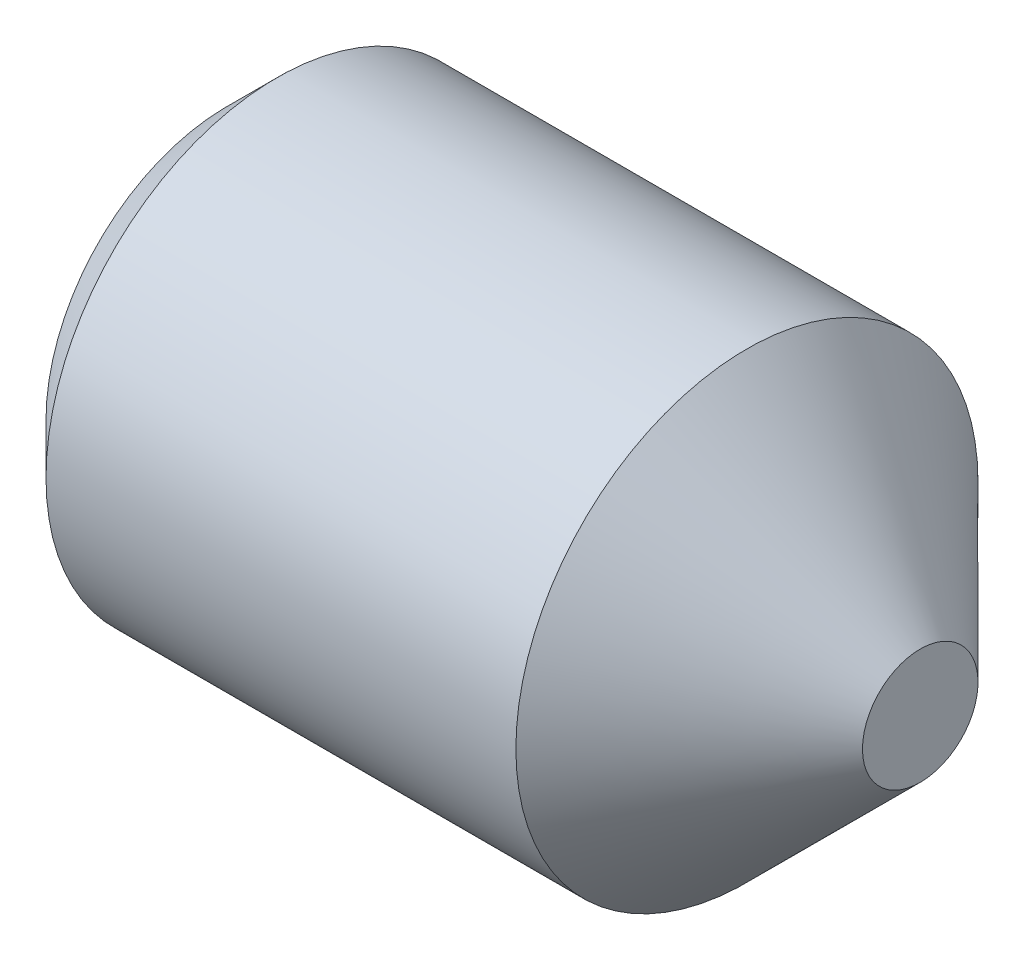
ISO-10303-21;
HEADER;
FILE_DESCRIPTION(('STEP AP214'),'2;1');
FILE_NAME('part.step','',(''),(''),'','','');
FILE_SCHEMA(('AUTOMOTIVE_DESIGN { 1 0 10303 214 1 1 1 1 }'));
ENDSEC;
DATA;
#1=APPLICATION_CONTEXT('core data for automotive mechanical design processes');
#2=APPLICATION_PROTOCOL_DEFINITION('international standard','automotive_design',2000,#1);
#3=PRODUCT_CONTEXT('',#1,'mechanical');
#4=PRODUCT('Part','Part','',(#3));
#5=PRODUCT_RELATED_PRODUCT_CATEGORY('part','',(#4));
#6=PRODUCT_DEFINITION_FORMATION('','',#4);
#7=PRODUCT_DEFINITION_CONTEXT('part definition',#1,'design');
#8=PRODUCT_DEFINITION('design','',#6,#7);
#9=PRODUCT_DEFINITION_SHAPE('','',#8);
#10=(LENGTH_UNIT() NAMED_UNIT(*) SI_UNIT(.MILLI.,.METRE.));
#11=(NAMED_UNIT(*) PLANE_ANGLE_UNIT() SI_UNIT($,.RADIAN.));
#12=(NAMED_UNIT(*) SI_UNIT($,.STERADIAN.) SOLID_ANGLE_UNIT());
#13=UNCERTAINTY_MEASURE_WITH_UNIT(LENGTH_MEASURE(1.E-05),#10,'distance_accuracy_value','');
#14=(GEOMETRIC_REPRESENTATION_CONTEXT(3) GLOBAL_UNCERTAINTY_ASSIGNED_CONTEXT((#13)) GLOBAL_UNIT_ASSIGNED_CONTEXT((#10,
#11,#12)) REPRESENTATION_CONTEXT('',''));
#15=CARTESIAN_POINT('',(0.,0.,0.));
#16=DIRECTION('',(0.,0.,1.));
#17=DIRECTION('',(1.,0.,0.));
#18=AXIS2_PLACEMENT_3D('',#15,#16,#17);
#19=CARTESIAN_POINT('',(0.799999999886313,0.,0.519615242270663));
#20=DIRECTION('',(-1.,0.,0.));
#21=DIRECTION('',(0.,0.,1.));
#22=AXIS2_PLACEMENT_3D('',#19,#20,#21);
#23=PLANE('',#22);
#24=DIRECTION('',(0.,0.,-1.));
#25=VECTOR('',#24,1.);
#26=CARTESIAN_POINT('',(0.799999999886313,0.45,0.259807621135332));
#27=LINE('',#26,#25);
#28=CARTESIAN_POINT('',(0.799999999886313,0.45,0.259807621135332));
#29=VERTEX_POINT('',#28);
#30=CARTESIAN_POINT('',(0.799999999886313,0.45,0.));
#31=VERTEX_POINT('',#30);
#32=EDGE_CURVE('E160',#29,#31,#27,.T.);
#33=ORIENTED_EDGE('',*,*,#32,.T.);
#34=CARTESIAN_POINT('',(0.799999999886313,0.,0.));
#35=DIRECTION('',(1.,0.,0.));
#36=DIRECTION('',(0.,1.,0.));
#37=AXIS2_PLACEMENT_3D('',#34,#35,#36);
#38=CIRCLE('',#37,0.45);
#39=CARTESIAN_POINT('',(0.799999999886313,0.225,0.389711431702997));
#40=VERTEX_POINT('',#39);
#41=EDGE_CURVE('E49',#31,#40,#38,.T.);
#42=ORIENTED_EDGE('',*,*,#41,.T.);
#43=DIRECTION('',(0.,0.866025403784438,-0.5));
#44=VECTOR('',#43,1.);
#45=CARTESIAN_POINT('',(0.799999999886313,0.,0.519615242270663));
#46=LINE('',#45,#44);
#47=EDGE_CURVE('E216',#40,#29,#46,.T.);
#48=ORIENTED_EDGE('',*,*,#47,.T.);
#49=EDGE_LOOP('',(#33,#42,#48));
#50=FACE_BOUND('',#49,.T.);
#51=ADVANCED_FACE('F38',(#50),#23,.T.);
#52=CARTESIAN_POINT('',(0.799999999886313,0.,0.519615242270663));
#53=VERTEX_POINT('',#52);
#54=EDGE_CURVE('E221',#53,#40,#46,.T.);
#55=ORIENTED_EDGE('',*,*,#54,.T.);
#56=CARTESIAN_POINT('',(0.799999999886313,-0.225,0.389711431702997));
#57=VERTEX_POINT('',#56);
#58=EDGE_CURVE('E11',#40,#57,#38,.T.);
#59=ORIENTED_EDGE('',*,*,#58,.T.);
#60=DIRECTION('',(0.,0.866025403784438,0.5));
#61=VECTOR('',#60,1.);
#62=CARTESIAN_POINT('',(0.799999999886313,-0.45,0.259807621135332));
#63=LINE('',#62,#61);
#64=EDGE_CURVE('E186',#57,#53,#63,.T.);
#65=ORIENTED_EDGE('',*,*,#64,.T.);
#66=EDGE_LOOP('',(#55,#59,#65));
#67=FACE_BOUND('',#66,.T.);
#68=ADVANCED_FACE('F125',(#67),#23,.T.);
#69=CARTESIAN_POINT('',(0.799999999886313,-0.45,0.259807621135332));
#70=VERTEX_POINT('',#69);
#71=EDGE_CURVE('E222',#70,#57,#63,.T.);
#72=ORIENTED_EDGE('',*,*,#71,.T.);
#73=CARTESIAN_POINT('',(0.799999999886313,-0.45,0.));
#74=VERTEX_POINT('',#73);
#75=EDGE_CURVE('E47',#57,#74,#38,.T.);
#76=ORIENTED_EDGE('',*,*,#75,.T.);
#77=DIRECTION('',(0.,0.,1.));
#78=VECTOR('',#77,1.);
#79=CARTESIAN_POINT('',(0.799999999886313,-0.45,-0.259807621135331));
#80=LINE('',#79,#78);
#81=EDGE_CURVE('E165',#74,#70,#80,.T.);
#82=ORIENTED_EDGE('',*,*,#81,.T.);
#83=EDGE_LOOP('',(#72,#76,#82));
#84=FACE_BOUND('',#83,.T.);
#85=ADVANCED_FACE('F131',(#84),#23,.T.);
#86=CARTESIAN_POINT('',(0.799999999886313,-0.45,-0.259807621135331));
#87=VERTEX_POINT('',#86);
#88=EDGE_CURVE('E166',#87,#74,#80,.T.);
#89=ORIENTED_EDGE('',*,*,#88,.T.);
#90=CARTESIAN_POINT('',(0.799999999886313,-0.225,-0.389711431702997));
#91=VERTEX_POINT('',#90);
#92=EDGE_CURVE('E213',#74,#91,#38,.T.);
#93=ORIENTED_EDGE('',*,*,#92,.T.);
#94=DIRECTION('',(0.,-0.866025403784439,0.5));
#95=VECTOR('',#94,1.);
#96=CARTESIAN_POINT('',(0.799999999886313,0.,-0.519615242270663));
#97=LINE('',#96,#95);
#98=EDGE_CURVE('E155',#91,#87,#97,.T.);
#99=ORIENTED_EDGE('',*,*,#98,.T.);
#100=EDGE_LOOP('',(#89,#93,#99));
#101=FACE_BOUND('',#100,.T.);
#102=ADVANCED_FACE('F144',(#101),#23,.T.);
#103=CARTESIAN_POINT('',(0.799999999886313,0.,-0.519615242270663));
#104=VERTEX_POINT('',#103);
#105=EDGE_CURVE('E158',#104,#91,#97,.T.);
#106=ORIENTED_EDGE('',*,*,#105,.T.);
#107=CARTESIAN_POINT('',(0.799999999886313,0.225,-0.389711431702997));
#108=VERTEX_POINT('',#107);
#109=EDGE_CURVE('E211',#91,#108,#38,.T.);
#110=ORIENTED_EDGE('',*,*,#109,.T.);
#111=DIRECTION('',(0.,-0.866025403784438,-0.5));
#112=VECTOR('',#111,1.);
#113=CARTESIAN_POINT('',(0.799999999886313,0.45,-0.259807621135332));
#114=LINE('',#113,#112);
#115=EDGE_CURVE('E156',#108,#104,#114,.T.);
#116=ORIENTED_EDGE('',*,*,#115,.T.);
#117=EDGE_LOOP('',(#106,#110,#116));
#118=FACE_BOUND('',#117,.T.);
#119=ADVANCED_FACE('F136',(#118),#23,.T.);
#120=CARTESIAN_POINT('',(0.799999999886313,0.45,-0.259807621135332));
#121=VERTEX_POINT('',#120);
#122=EDGE_CURVE('E148',#121,#108,#114,.T.);
#123=ORIENTED_EDGE('',*,*,#122,.T.);
#124=EDGE_CURVE('E149',#108,#31,#38,.T.);
#125=ORIENTED_EDGE('',*,*,#124,.T.);
#126=EDGE_CURVE('E151',#31,#121,#27,.T.);
#127=ORIENTED_EDGE('',*,*,#126,.T.);
#128=EDGE_LOOP('',(#123,#125,#127));
#129=FACE_BOUND('',#128,.T.);
#130=ADVANCED_FACE('F127',(#129),#23,.T.);
#131=CARTESIAN_POINT('',(0.,0.7835,0.));
#132=DIRECTION('',(1.,0.,0.));
#133=DIRECTION('',(0.,0.,-1.));
#134=AXIS2_PLACEMENT_3D('',#131,#132,#133);
#135=PLANE('',#134);
#136=DIRECTION('',(0.,0.866025403784438,-0.5));
#137=VECTOR('',#136,1.);
#138=CARTESIAN_POINT('',(-1.13686837721616E-10,0.,0.519615242270663));
#139=LINE('',#138,#137);
#140=CARTESIAN_POINT('',(0.,0.,0.519615242270663));
#141=VERTEX_POINT('',#140);
#142=CARTESIAN_POINT('',(-1.13686837721616E-10,0.45,0.259807621135332));
#143=VERTEX_POINT('',#142);
#144=EDGE_CURVE('E171',#141,#143,#139,.T.);
#145=ORIENTED_EDGE('',*,*,#144,.F.);
#146=DIRECTION('',(0.,0.866025403784438,0.5));
#147=VECTOR('',#146,1.);
#148=CARTESIAN_POINT('',(-1.13686837721616E-10,-0.45,0.259807621135332));
#149=LINE('',#148,#147);
#150=CARTESIAN_POINT('',(-1.13686837721616E-10,-0.45,0.259807621135332));
#151=VERTEX_POINT('',#150);
#152=EDGE_CURVE('E63',#151,#141,#149,.T.);
#153=ORIENTED_EDGE('',*,*,#152,.F.);
#154=DIRECTION('',(0.,0.,1.));
#155=VECTOR('',#154,1.);
#156=CARTESIAN_POINT('',(-1.13686837721616E-10,-0.45,-0.259807621135331));
#157=LINE('',#156,#155);
#158=CARTESIAN_POINT('',(-1.13686837721616E-10,-0.45,-0.259807621135331));
#159=VERTEX_POINT('',#158);
#160=EDGE_CURVE('E183',#159,#151,#157,.T.);
#161=ORIENTED_EDGE('',*,*,#160,.F.);
#162=DIRECTION('',(0.,-0.866025403784439,0.5));
#163=VECTOR('',#162,1.);
#164=CARTESIAN_POINT('',(-1.13686837721616E-10,0.,-0.519615242270663));
#165=LINE('',#164,#163);
#166=CARTESIAN_POINT('',(-1.13686837721616E-10,0.,-0.519615242270663));
#167=VERTEX_POINT('',#166);
#168=EDGE_CURVE('E180',#167,#159,#165,.T.);
#169=ORIENTED_EDGE('',*,*,#168,.F.);
#170=DIRECTION('',(0.,-0.866025403784438,-0.5));
#171=VECTOR('',#170,1.);
#172=CARTESIAN_POINT('',(-1.13686837721616E-10,0.45,-0.259807621135332));
#173=LINE('',#172,#171);
#174=CARTESIAN_POINT('',(-1.13686837721616E-10,0.45,-0.259807621135332));
#175=VERTEX_POINT('',#174);
#176=EDGE_CURVE('E177',#175,#167,#173,.T.);
#177=ORIENTED_EDGE('',*,*,#176,.F.);
#178=DIRECTION('',(0.,0.,-1.));
#179=VECTOR('',#178,1.);
#180=CARTESIAN_POINT('',(-1.13686837721616E-10,0.45,0.259807621135332));
#181=LINE('',#180,#179);
#182=EDGE_CURVE('E174',#143,#175,#181,.T.);
#183=ORIENTED_EDGE('',*,*,#182,.F.);
#184=EDGE_LOOP('',(#145,#153,#161,#169,#177,#183));
#185=FACE_BOUND('',#184,.T.);
#186=CARTESIAN_POINT('',(0.,0.,0.));
#187=DIRECTION('',(-1.,0.,0.));
#188=DIRECTION('',(0.,0.,1.));
#189=AXIS2_PLACEMENT_3D('',#186,#187,#188);
#190=CIRCLE('',#189,0.7835);
#191=CARTESIAN_POINT('',(0.,0.,0.7835));
#192=VERTEX_POINT('',#191);
#193=EDGE_CURVE('E189',#192,#192,#190,.T.);
#194=ORIENTED_EDGE('',*,*,#193,.T.);
#195=EDGE_LOOP('',(#194));
#196=FACE_BOUND('',#195,.T.);
#197=ADVANCED_FACE('F40',(#185,#196),#135,.F.);
#198=CARTESIAN_POINT('',(3.,0.,0.));
#199=DIRECTION('',(-1.,0.,0.));
#200=DIRECTION('',(0.,0.,1.));
#201=AXIS2_PLACEMENT_3D('',#198,#199,#200);
#202=PLANE('',#201);
#203=CARTESIAN_POINT('',(3.,0.,0.));
#204=DIRECTION('',(-1.,0.,0.));
#205=DIRECTION('',(0.,0.,1.));
#206=AXIS2_PLACEMENT_3D('',#203,#204,#205);
#207=CIRCLE('',#206,0.25);
#208=CARTESIAN_POINT('',(3.,0.,0.25));
#209=VERTEX_POINT('',#208);
#210=EDGE_CURVE('E42',#209,#209,#207,.T.);
#211=ORIENTED_EDGE('',*,*,#210,.F.);
#212=EDGE_LOOP('',(#211));
#213=FACE_BOUND('',#212,.T.);
#214=ADVANCED_FACE('F142',(#213),#202,.F.);
#215=CARTESIAN_POINT('',(3.,0.,0.));
#216=DIRECTION('',(-1.,0.,0.));
#217=DIRECTION('',(0.,0.,1.));
#218=AXIS2_PLACEMENT_3D('',#215,#216,#217);
#219=CONICAL_SURFACE('',#218,0.25,0.785398163397443);
#220=CARTESIAN_POINT('',(2.24999999999999,0.,0.));
#221=DIRECTION('',(-1.,0.,0.));
#222=DIRECTION('',(0.,0.,1.));
#223=AXIS2_PLACEMENT_3D('',#220,#221,#222);
#224=CIRCLE('',#223,1.);
#225=CARTESIAN_POINT('',(2.24999999999999,0.,1.));
#226=VERTEX_POINT('',#225);
#227=EDGE_CURVE('E204',#226,#226,#224,.T.);
#228=ORIENTED_EDGE('',*,*,#227,.F.);
#229=EDGE_LOOP('',(#228));
#230=FACE_BOUND('',#229,.T.);
#231=ORIENTED_EDGE('',*,*,#210,.T.);
#232=EDGE_LOOP('',(#231));
#233=FACE_BOUND('',#232,.T.);
#234=ADVANCED_FACE('F269',(#230,#233),#219,.T.);
#235=CARTESIAN_POINT('',(-14.774129749189,0.,0.));
#236=DIRECTION('',(-1.,0.,0.));
#237=DIRECTION('',(0.,0.,1.));
#238=AXIS2_PLACEMENT_3D('',#235,#236,#237);
#239=CYLINDRICAL_SURFACE('',#238,1.);
#240=CARTESIAN_POINT('',(0.216500000000001,0.,0.));
#241=DIRECTION('',(-1.,0.,0.));
#242=DIRECTION('',(0.,0.,1.));
#243=AXIS2_PLACEMENT_3D('',#240,#241,#242);
#244=CIRCLE('',#243,1.);
#245=CARTESIAN_POINT('',(0.216500000000001,0.,1.));
#246=VERTEX_POINT('',#245);
#247=EDGE_CURVE('E202',#246,#246,#244,.T.);
#248=ORIENTED_EDGE('',*,*,#247,.F.);
#249=EDGE_LOOP('',(#248));
#250=FACE_BOUND('',#249,.T.);
#251=ORIENTED_EDGE('',*,*,#227,.T.);
#252=EDGE_LOOP('',(#251));
#253=FACE_BOUND('',#252,.T.);
#254=ADVANCED_FACE('F265',(#250,#253),#239,.T.);
#255=CARTESIAN_POINT('',(0.216500000000001,0.,0.));
#256=DIRECTION('',(1.,0.,0.));
#257=DIRECTION('',(0.,0.,-1.));
#258=AXIS2_PLACEMENT_3D('',#255,#256,#257);
#259=CONICAL_SURFACE('',#258,1.,0.785398163397445);
#260=ORIENTED_EDGE('',*,*,#193,.F.);
#261=EDGE_LOOP('',(#260));
#262=FACE_BOUND('',#261,.T.);
#263=ORIENTED_EDGE('',*,*,#247,.T.);
#264=EDGE_LOOP('',(#263));
#265=FACE_BOUND('',#264,.T.);
#266=ADVANCED_FACE('F256',(#262,#265),#259,.T.);
#267=CARTESIAN_POINT('',(0.799999999886313,-0.45,0.259807621135332));
#268=DIRECTION('',(0.,-0.5,0.866025403784438));
#269=DIRECTION('',(0.,-0.866025403784439,-0.5));
#270=AXIS2_PLACEMENT_3D('',#267,#268,#269);
#271=PLANE('',#270);
#272=ORIENTED_EDGE('',*,*,#152,.T.);
#273=DIRECTION('',(-1.,0.,0.));
#274=VECTOR('',#273,1.);
#275=CARTESIAN_POINT('',(0.799999999886313,0.,0.519615242270663));
#276=LINE('',#275,#274);
#277=EDGE_CURVE('E169',#53,#141,#276,.T.);
#278=ORIENTED_EDGE('',*,*,#277,.F.);
#279=ORIENTED_EDGE('',*,*,#64,.F.);
#280=ORIENTED_EDGE('',*,*,#71,.F.);
#281=DIRECTION('',(-1.,0.,0.));
#282=VECTOR('',#281,1.);
#283=CARTESIAN_POINT('',(0.799999999886313,-0.45,0.259807621135332));
#284=LINE('',#283,#282);
#285=EDGE_CURVE('E187',#70,#151,#284,.T.);
#286=ORIENTED_EDGE('',*,*,#285,.T.);
#287=EDGE_LOOP('',(#272,#278,#279,#280,#286));
#288=FACE_BOUND('',#287,.T.);
#289=ADVANCED_FACE('F230',(#288),#271,.F.);
#290=CARTESIAN_POINT('',(0.799999999886313,-0.45,-0.259807621135331));
#291=DIRECTION('',(0.,-1.,0.));
#292=DIRECTION('',(0.,0.,-1.));
#293=AXIS2_PLACEMENT_3D('',#290,#291,#292);
#294=PLANE('',#293);
#295=ORIENTED_EDGE('',*,*,#160,.T.);
#296=ORIENTED_EDGE('',*,*,#285,.F.);
#297=ORIENTED_EDGE('',*,*,#81,.F.);
#298=ORIENTED_EDGE('',*,*,#88,.F.);
#299=DIRECTION('',(-1.,0.,0.));
#300=VECTOR('',#299,1.);
#301=CARTESIAN_POINT('',(0.799999999886313,-0.45,-0.259807621135331));
#302=LINE('',#301,#300);
#303=EDGE_CURVE('E190',#87,#159,#302,.T.);
#304=ORIENTED_EDGE('',*,*,#303,.T.);
#305=EDGE_LOOP('',(#295,#296,#297,#298,#304));
#306=FACE_BOUND('',#305,.T.);
#307=ADVANCED_FACE('F249',(#306),#294,.F.);
#308=CARTESIAN_POINT('',(0.799999999886313,0.,-0.519615242270663));
#309=DIRECTION('',(0.,-0.5,-0.866025403784439));
#310=DIRECTION('',(0.,0.866025403784439,-0.5));
#311=AXIS2_PLACEMENT_3D('',#308,#309,#310);
#312=PLANE('',#311);
#313=ORIENTED_EDGE('',*,*,#168,.T.);
#314=ORIENTED_EDGE('',*,*,#303,.F.);
#315=ORIENTED_EDGE('',*,*,#98,.F.);
#316=ORIENTED_EDGE('',*,*,#105,.F.);
#317=DIRECTION('',(-1.,0.,0.));
#318=VECTOR('',#317,1.);
#319=CARTESIAN_POINT('',(0.799999999886313,0.,-0.519615242270663));
#320=LINE('',#319,#318);
#321=EDGE_CURVE('E192',#104,#167,#320,.T.);
#322=ORIENTED_EDGE('',*,*,#321,.T.);
#323=EDGE_LOOP('',(#313,#314,#315,#316,#322));
#324=FACE_BOUND('',#323,.T.);
#325=ADVANCED_FACE('F243',(#324),#312,.F.);
#326=CARTESIAN_POINT('',(0.799999999886313,0.45,-0.259807621135332));
#327=DIRECTION('',(0.,0.5,-0.866025403784438));
#328=DIRECTION('',(0.,0.866025403784439,0.5));
#329=AXIS2_PLACEMENT_3D('',#326,#327,#328);
#330=PLANE('',#329);
#331=ORIENTED_EDGE('',*,*,#176,.T.);
#332=ORIENTED_EDGE('',*,*,#321,.F.);
#333=ORIENTED_EDGE('',*,*,#115,.F.);
#334=ORIENTED_EDGE('',*,*,#122,.F.);
#335=DIRECTION('',(-1.,0.,0.));
#336=VECTOR('',#335,1.);
#337=CARTESIAN_POINT('',(0.799999999886313,0.45,-0.259807621135332));
#338=LINE('',#337,#336);
#339=EDGE_CURVE('E194',#121,#175,#338,.T.);
#340=ORIENTED_EDGE('',*,*,#339,.T.);
#341=EDGE_LOOP('',(#331,#332,#333,#334,#340));
#342=FACE_BOUND('',#341,.T.);
#343=ADVANCED_FACE('F238',(#342),#330,.F.);
#344=CARTESIAN_POINT('',(0.799999999886313,0.45,0.259807621135332));
#345=DIRECTION('',(0.,1.,0.));
#346=DIRECTION('',(0.,0.,1.));
#347=AXIS2_PLACEMENT_3D('',#344,#345,#346);
#348=PLANE('',#347);
#349=ORIENTED_EDGE('',*,*,#182,.T.);
#350=ORIENTED_EDGE('',*,*,#339,.F.);
#351=ORIENTED_EDGE('',*,*,#126,.F.);
#352=ORIENTED_EDGE('',*,*,#32,.F.);
#353=DIRECTION('',(-1.,0.,0.));
#354=VECTOR('',#353,1.);
#355=CARTESIAN_POINT('',(0.799999999886313,0.45,0.259807621135332));
#356=LINE('',#355,#354);
#357=EDGE_CURVE('E196',#29,#143,#356,.T.);
#358=ORIENTED_EDGE('',*,*,#357,.T.);
#359=EDGE_LOOP('',(#349,#350,#351,#352,#358));
#360=FACE_BOUND('',#359,.T.);
#361=ADVANCED_FACE('F120',(#360),#348,.F.);
#362=CARTESIAN_POINT('',(0.799999999886313,0.,0.519615242270663));
#363=DIRECTION('',(0.,0.5,0.866025403784438));
#364=DIRECTION('',(0.,-0.866025403784438,0.5));
#365=AXIS2_PLACEMENT_3D('',#362,#363,#364);
#366=PLANE('',#365);
#367=ORIENTED_EDGE('',*,*,#144,.T.);
#368=ORIENTED_EDGE('',*,*,#357,.F.);
#369=ORIENTED_EDGE('',*,*,#47,.F.);
#370=ORIENTED_EDGE('',*,*,#54,.F.);
#371=ORIENTED_EDGE('',*,*,#277,.T.);
#372=EDGE_LOOP('',(#367,#368,#369,#370,#371));
#373=FACE_BOUND('',#372,.T.);
#374=ADVANCED_FACE('F115',(#373),#366,.F.);
#375=CARTESIAN_POINT('',(1.05980762102165,0.,0.));
#376=DIRECTION('',(-1.,0.,0.));
#377=DIRECTION('',(0.,-1.,0.));
#378=AXIS2_PLACEMENT_3D('',#375,#376,#377);
#379=CONICAL_SURFACE('',#378,0.,1.0471975511966);
#380=ORIENTED_EDGE('',*,*,#41,.F.);
#381=ORIENTED_EDGE('',*,*,#124,.F.);
#382=ORIENTED_EDGE('',*,*,#109,.F.);
#383=ORIENTED_EDGE('',*,*,#92,.F.);
#384=ORIENTED_EDGE('',*,*,#75,.F.);
#385=ORIENTED_EDGE('',*,*,#58,.F.);
#386=EDGE_LOOP('',(#380,#381,#382,#383,#384,#385));
#387=FACE_BOUND('',#386,.T.);
#388=CARTESIAN_POINT('',(1.05980762102165,0.,0.));
#389=VERTEX_POINT('',#388);
#390=VERTEX_LOOP('',#389);
#391=FACE_BOUND('',#390,.T.);
#392=ADVANCED_FACE('F113',(#387,#391),#379,.F.);
#393=CLOSED_SHELL('',(#51,#68,#85,#102,#119,#130,#197,#214,#234,#254,#266,#289,#307,#325,#343,
#361,#374,#392));
#394=MANIFOLD_SOLID_BREP('B2',#393);
#395=ADVANCED_BREP_SHAPE_REPRESENTATION('',(#18,#394),#14);
#396=SHAPE_DEFINITION_REPRESENTATION(#9,#395);
ENDSEC;
END-ISO-10303-21;
